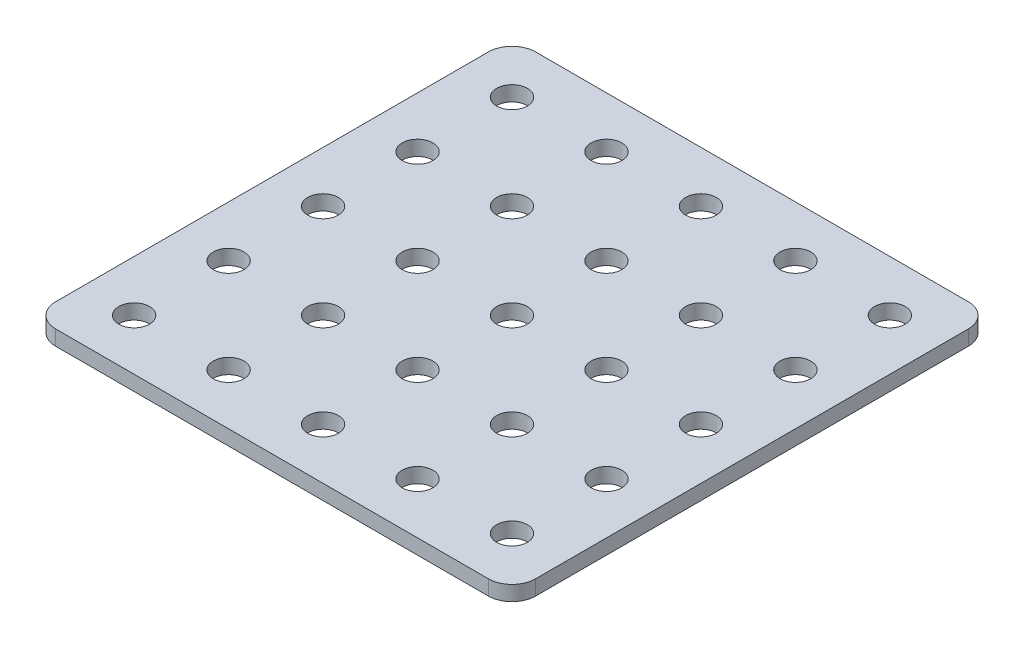
ISO-10303-21;
HEADER;
FILE_DESCRIPTION(('STEP AP214'),'2;1');
FILE_NAME('part.step','',(''),(''),'','','');
FILE_SCHEMA(('AUTOMOTIVE_DESIGN { 1 0 10303 214 1 1 1 1 }'));
ENDSEC;
DATA;
#1=APPLICATION_CONTEXT('core data for automotive mechanical design processes');
#2=APPLICATION_PROTOCOL_DEFINITION('international standard','automotive_design',2000,#1);
#3=PRODUCT_CONTEXT('',#1,'mechanical');
#4=PRODUCT('Part','Part','',(#3));
#5=PRODUCT_RELATED_PRODUCT_CATEGORY('part','',(#4));
#6=PRODUCT_DEFINITION_FORMATION('','',#4);
#7=PRODUCT_DEFINITION_CONTEXT('part definition',#1,'design');
#8=PRODUCT_DEFINITION('design','',#6,#7);
#9=PRODUCT_DEFINITION_SHAPE('','',#8);
#10=(LENGTH_UNIT() NAMED_UNIT(*) SI_UNIT(.MILLI.,.METRE.));
#11=(NAMED_UNIT(*) PLANE_ANGLE_UNIT() SI_UNIT($,.RADIAN.));
#12=(NAMED_UNIT(*) SI_UNIT($,.STERADIAN.) SOLID_ANGLE_UNIT());
#13=UNCERTAINTY_MEASURE_WITH_UNIT(LENGTH_MEASURE(1.E-05),#10,'distance_accuracy_value','');
#14=(GEOMETRIC_REPRESENTATION_CONTEXT(3) GLOBAL_UNCERTAINTY_ASSIGNED_CONTEXT((#13)) GLOBAL_UNIT_ASSIGNED_CONTEXT((#10,
#11,#12)) REPRESENTATION_CONTEXT('',''));
#15=CARTESIAN_POINT('',(0.,0.,0.));
#16=DIRECTION('',(0.,0.,1.));
#17=DIRECTION('',(1.,0.,0.));
#18=AXIS2_PLACEMENT_3D('',#15,#16,#17);
#19=CARTESIAN_POINT('',(50.8,3.175,-50.8));
#20=DIRECTION('',(-1.,0.,0.));
#21=DIRECTION('',(0.,0.,1.));
#22=AXIS2_PLACEMENT_3D('',#19,#20,#21);
#23=PLANE('',#22);
#24=DIRECTION('',(0.,0.,-1.));
#25=VECTOR('',#24,1.);
#26=CARTESIAN_POINT('',(50.8,0.,-50.8));
#27=LINE('',#26,#25);
#28=CARTESIAN_POINT('',(50.8,0.,45.8));
#29=VERTEX_POINT('',#28);
#30=CARTESIAN_POINT('',(50.8,0.,-45.8));
#31=VERTEX_POINT('',#30);
#32=EDGE_CURVE('E129',#29,#31,#27,.T.);
#33=ORIENTED_EDGE('',*,*,#32,.T.);
#34=DIRECTION('',(0.,-1.,0.));
#35=VECTOR('',#34,1.);
#36=CARTESIAN_POINT('',(50.8,3.175,-45.8));
#37=LINE('',#36,#35);
#38=CARTESIAN_POINT('',(50.8,3.175,-45.8));
#39=VERTEX_POINT('',#38);
#40=EDGE_CURVE('E106',#31,#39,#37,.F.);
#41=ORIENTED_EDGE('',*,*,#40,.T.);
#42=DIRECTION('',(0.,0.,-1.));
#43=VECTOR('',#42,1.);
#44=CARTESIAN_POINT('',(50.8,3.175,-50.8));
#45=LINE('',#44,#43);
#46=CARTESIAN_POINT('',(50.8,3.175,45.8));
#47=VERTEX_POINT('',#46);
#48=EDGE_CURVE('E139',#47,#39,#45,.T.);
#49=ORIENTED_EDGE('',*,*,#48,.F.);
#50=DIRECTION('',(0.,-1.,0.));
#51=VECTOR('',#50,1.);
#52=CARTESIAN_POINT('',(50.8,3.175,45.8));
#53=LINE('',#52,#51);
#54=EDGE_CURVE('E111',#47,#29,#53,.T.);
#55=ORIENTED_EDGE('',*,*,#54,.T.);
#56=EDGE_LOOP('',(#33,#41,#49,#55));
#57=FACE_BOUND('',#56,.T.);
#58=ADVANCED_FACE('F34',(#57),#23,.F.);
#59=CARTESIAN_POINT('',(-50.8,3.175,-50.8));
#60=DIRECTION('',(0.,0.,1.));
#61=DIRECTION('',(1.,0.,0.));
#62=AXIS2_PLACEMENT_3D('',#59,#60,#61);
#63=PLANE('',#62);
#64=DIRECTION('',(-1.,0.,0.));
#65=VECTOR('',#64,1.);
#66=CARTESIAN_POINT('',(-50.8,3.175,-50.8));
#67=LINE('',#66,#65);
#68=CARTESIAN_POINT('',(45.8,3.175,-50.8));
#69=VERTEX_POINT('',#68);
#70=CARTESIAN_POINT('',(-45.8,3.175,-50.8));
#71=VERTEX_POINT('',#70);
#72=EDGE_CURVE('E121',#69,#71,#67,.T.);
#73=ORIENTED_EDGE('',*,*,#72,.F.);
#74=DIRECTION('',(0.,-1.,0.));
#75=VECTOR('',#74,1.);
#76=CARTESIAN_POINT('',(45.8,3.175,-50.8));
#77=LINE('',#76,#75);
#78=CARTESIAN_POINT('',(45.8,0.,-50.8));
#79=VERTEX_POINT('',#78);
#80=EDGE_CURVE('E105',#69,#79,#77,.T.);
#81=ORIENTED_EDGE('',*,*,#80,.T.);
#82=DIRECTION('',(-1.,0.,0.));
#83=VECTOR('',#82,1.);
#84=CARTESIAN_POINT('',(-50.8,0.,-50.8));
#85=LINE('',#84,#83);
#86=CARTESIAN_POINT('',(-45.8,0.,-50.8));
#87=VERTEX_POINT('',#86);
#88=EDGE_CURVE('E118',#79,#87,#85,.T.);
#89=ORIENTED_EDGE('',*,*,#88,.T.);
#90=DIRECTION('',(0.,-1.,0.));
#91=VECTOR('',#90,1.);
#92=CARTESIAN_POINT('',(-45.8,3.175,-50.8));
#93=LINE('',#92,#91);
#94=EDGE_CURVE('E123',#87,#71,#93,.F.);
#95=ORIENTED_EDGE('',*,*,#94,.T.);
#96=EDGE_LOOP('',(#73,#81,#89,#95));
#97=FACE_BOUND('',#96,.T.);
#98=ADVANCED_FACE('F117',(#97),#63,.F.);
#99=CARTESIAN_POINT('',(-50.8,3.175,-50.8));
#100=DIRECTION('',(1.,0.,0.));
#101=DIRECTION('',(0.,0.,-1.));
#102=AXIS2_PLACEMENT_3D('',#99,#100,#101);
#103=PLANE('',#102);
#104=DIRECTION('',(0.,0.,1.));
#105=VECTOR('',#104,1.);
#106=CARTESIAN_POINT('',(-50.8,3.175,-50.8));
#107=LINE('',#106,#105);
#108=CARTESIAN_POINT('',(-50.8,3.175,-45.8));
#109=VERTEX_POINT('',#108);
#110=CARTESIAN_POINT('',(-50.8,3.175,45.8));
#111=VERTEX_POINT('',#110);
#112=EDGE_CURVE('E389',#109,#111,#107,.T.);
#113=ORIENTED_EDGE('',*,*,#112,.F.);
#114=DIRECTION('',(0.,-1.,0.));
#115=VECTOR('',#114,1.);
#116=CARTESIAN_POINT('',(-50.8,3.175,-45.8));
#117=LINE('',#116,#115);
#118=CARTESIAN_POINT('',(-50.8,0.,-45.8));
#119=VERTEX_POINT('',#118);
#120=EDGE_CURVE('E158',#109,#119,#117,.T.);
#121=ORIENTED_EDGE('',*,*,#120,.T.);
#122=DIRECTION('',(0.,0.,1.));
#123=VECTOR('',#122,1.);
#124=CARTESIAN_POINT('',(-50.8,0.,-50.8));
#125=LINE('',#124,#123);
#126=CARTESIAN_POINT('',(-50.8,0.,45.8));
#127=VERTEX_POINT('',#126);
#128=EDGE_CURVE('E128',#119,#127,#125,.T.);
#129=ORIENTED_EDGE('',*,*,#128,.T.);
#130=DIRECTION('',(0.,-1.,0.));
#131=VECTOR('',#130,1.);
#132=CARTESIAN_POINT('',(-50.8,3.175,45.8));
#133=LINE('',#132,#131);
#134=EDGE_CURVE('E156',#127,#111,#133,.F.);
#135=ORIENTED_EDGE('',*,*,#134,.T.);
#136=EDGE_LOOP('',(#113,#121,#129,#135));
#137=FACE_BOUND('',#136,.T.);
#138=ADVANCED_FACE('F238',(#137),#103,.F.);
#139=CARTESIAN_POINT('',(-50.8,3.175,50.8));
#140=DIRECTION('',(0.,0.,-1.));
#141=DIRECTION('',(-1.,0.,0.));
#142=AXIS2_PLACEMENT_3D('',#139,#140,#141);
#143=PLANE('',#142);
#144=DIRECTION('',(1.,0.,0.));
#145=VECTOR('',#144,1.);
#146=CARTESIAN_POINT('',(-50.8,3.175,50.8));
#147=LINE('',#146,#145);
#148=CARTESIAN_POINT('',(-45.8,3.175,50.8));
#149=VERTEX_POINT('',#148);
#150=CARTESIAN_POINT('',(45.8,3.175,50.8));
#151=VERTEX_POINT('',#150);
#152=EDGE_CURVE('E140',#149,#151,#147,.T.);
#153=ORIENTED_EDGE('',*,*,#152,.F.);
#154=DIRECTION('',(0.,-1.,0.));
#155=VECTOR('',#154,1.);
#156=CARTESIAN_POINT('',(-45.8,3.175,50.8));
#157=LINE('',#156,#155);
#158=CARTESIAN_POINT('',(-45.8,0.,50.8));
#159=VERTEX_POINT('',#158);
#160=EDGE_CURVE('E162',#149,#159,#157,.T.);
#161=ORIENTED_EDGE('',*,*,#160,.T.);
#162=DIRECTION('',(1.,0.,0.));
#163=VECTOR('',#162,1.);
#164=CARTESIAN_POINT('',(-50.8,0.,50.8));
#165=LINE('',#164,#163);
#166=CARTESIAN_POINT('',(45.8,0.,50.8));
#167=VERTEX_POINT('',#166);
#168=EDGE_CURVE('E132',#159,#167,#165,.T.);
#169=ORIENTED_EDGE('',*,*,#168,.T.);
#170=DIRECTION('',(0.,-1.,0.));
#171=VECTOR('',#170,1.);
#172=CARTESIAN_POINT('',(45.8,3.175,50.8));
#173=LINE('',#172,#171);
#174=EDGE_CURVE('E49',#167,#151,#173,.F.);
#175=ORIENTED_EDGE('',*,*,#174,.T.);
#176=EDGE_LOOP('',(#153,#161,#169,#175));
#177=FACE_BOUND('',#176,.T.);
#178=ADVANCED_FACE('F229',(#177),#143,.F.);
#179=CARTESIAN_POINT('',(0.,3.175,0.));
#180=DIRECTION('',(0.,1.,0.));
#181=DIRECTION('',(0.,0.,1.));
#182=AXIS2_PLACEMENT_3D('',#179,#180,#181);
#183=PLANE('',#182);
#184=CARTESIAN_POINT('',(-20.,3.175,-20.));
#185=DIRECTION('',(0.,1.,0.));
#186=DIRECTION('',(0.,0.,1.));
#187=AXIS2_PLACEMENT_3D('',#184,#185,#186);
#188=CIRCLE('',#187,3.25);
#189=CARTESIAN_POINT('',(-20.,3.175,-16.75));
#190=VERTEX_POINT('',#189);
#191=EDGE_CURVE('E699',#190,#190,#188,.T.);
#192=ORIENTED_EDGE('',*,*,#191,.F.);
#193=EDGE_LOOP('',(#192));
#194=FACE_BOUND('',#193,.T.);
#195=CARTESIAN_POINT('',(40.,3.175,-20.));
#196=DIRECTION('',(0.,1.,0.));
#197=DIRECTION('',(0.,0.,1.));
#198=AXIS2_PLACEMENT_3D('',#195,#196,#197);
#199=CIRCLE('',#198,3.25);
#200=CARTESIAN_POINT('',(40.,3.175,-16.75));
#201=VERTEX_POINT('',#200);
#202=EDGE_CURVE('E693',#201,#201,#199,.T.);
#203=ORIENTED_EDGE('',*,*,#202,.F.);
#204=EDGE_LOOP('',(#203));
#205=FACE_BOUND('',#204,.T.);
#206=CARTESIAN_POINT('',(20.,3.175,-20.));
#207=DIRECTION('',(0.,1.,0.));
#208=DIRECTION('',(0.,0.,1.));
#209=AXIS2_PLACEMENT_3D('',#206,#207,#208);
#210=CIRCLE('',#209,3.25);
#211=CARTESIAN_POINT('',(20.,3.175,-16.75));
#212=VERTEX_POINT('',#211);
#213=EDGE_CURVE('E687',#212,#212,#210,.T.);
#214=ORIENTED_EDGE('',*,*,#213,.F.);
#215=EDGE_LOOP('',(#214));
#216=FACE_BOUND('',#215,.T.);
#217=CARTESIAN_POINT('',(0.,3.175,-20.));
#218=DIRECTION('',(0.,1.,0.));
#219=DIRECTION('',(0.,0.,1.));
#220=AXIS2_PLACEMENT_3D('',#217,#218,#219);
#221=CIRCLE('',#220,3.25);
#222=CARTESIAN_POINT('',(0.,3.175,-16.75));
#223=VERTEX_POINT('',#222);
#224=EDGE_CURVE('E681',#223,#223,#221,.T.);
#225=ORIENTED_EDGE('',*,*,#224,.F.);
#226=EDGE_LOOP('',(#225));
#227=FACE_BOUND('',#226,.T.);
#228=CARTESIAN_POINT('',(-40.,3.175,-20.));
#229=DIRECTION('',(0.,1.,0.));
#230=DIRECTION('',(0.,0.,1.));
#231=AXIS2_PLACEMENT_3D('',#228,#229,#230);
#232=CIRCLE('',#231,3.25);
#233=CARTESIAN_POINT('',(-40.,3.175,-16.75));
#234=VERTEX_POINT('',#233);
#235=EDGE_CURVE('E675',#234,#234,#232,.T.);
#236=ORIENTED_EDGE('',*,*,#235,.F.);
#237=EDGE_LOOP('',(#236));
#238=FACE_BOUND('',#237,.T.);
#239=CARTESIAN_POINT('',(-20.,3.175,20.));
#240=DIRECTION('',(0.,1.,0.));
#241=DIRECTION('',(0.,0.,1.));
#242=AXIS2_PLACEMENT_3D('',#239,#240,#241);
#243=CIRCLE('',#242,3.25);
#244=CARTESIAN_POINT('',(-20.,3.175,23.25));
#245=VERTEX_POINT('',#244);
#246=EDGE_CURVE('E669',#245,#245,#243,.T.);
#247=ORIENTED_EDGE('',*,*,#246,.F.);
#248=EDGE_LOOP('',(#247));
#249=FACE_BOUND('',#248,.T.);
#250=CARTESIAN_POINT('',(40.,3.175,20.));
#251=DIRECTION('',(0.,1.,0.));
#252=DIRECTION('',(0.,0.,1.));
#253=AXIS2_PLACEMENT_3D('',#250,#251,#252);
#254=CIRCLE('',#253,3.25);
#255=CARTESIAN_POINT('',(40.,3.175,23.25));
#256=VERTEX_POINT('',#255);
#257=EDGE_CURVE('E663',#256,#256,#254,.T.);
#258=ORIENTED_EDGE('',*,*,#257,.F.);
#259=EDGE_LOOP('',(#258));
#260=FACE_BOUND('',#259,.T.);
#261=CARTESIAN_POINT('',(20.,3.175,20.));
#262=DIRECTION('',(0.,1.,0.));
#263=DIRECTION('',(0.,0.,1.));
#264=AXIS2_PLACEMENT_3D('',#261,#262,#263);
#265=CIRCLE('',#264,3.25);
#266=CARTESIAN_POINT('',(20.,3.175,23.25));
#267=VERTEX_POINT('',#266);
#268=EDGE_CURVE('E657',#267,#267,#265,.T.);
#269=ORIENTED_EDGE('',*,*,#268,.F.);
#270=EDGE_LOOP('',(#269));
#271=FACE_BOUND('',#270,.T.);
#272=CARTESIAN_POINT('',(0.,3.175,20.));
#273=DIRECTION('',(0.,1.,0.));
#274=DIRECTION('',(0.,0.,1.));
#275=AXIS2_PLACEMENT_3D('',#272,#273,#274);
#276=CIRCLE('',#275,3.25);
#277=CARTESIAN_POINT('',(0.,3.175,23.25));
#278=VERTEX_POINT('',#277);
#279=EDGE_CURVE('E651',#278,#278,#276,.T.);
#280=ORIENTED_EDGE('',*,*,#279,.F.);
#281=EDGE_LOOP('',(#280));
#282=FACE_BOUND('',#281,.T.);
#283=CARTESIAN_POINT('',(-40.,3.175,20.));
#284=DIRECTION('',(0.,1.,0.));
#285=DIRECTION('',(0.,0.,1.));
#286=AXIS2_PLACEMENT_3D('',#283,#284,#285);
#287=CIRCLE('',#286,3.25);
#288=CARTESIAN_POINT('',(-40.,3.175,23.25));
#289=VERTEX_POINT('',#288);
#290=EDGE_CURVE('E643',#289,#289,#287,.T.);
#291=ORIENTED_EDGE('',*,*,#290,.F.);
#292=EDGE_LOOP('',(#291));
#293=FACE_BOUND('',#292,.T.);
#294=CARTESIAN_POINT('',(-40.,3.175,0.));
#295=DIRECTION('',(0.,1.,0.));
#296=DIRECTION('',(0.,0.,1.));
#297=AXIS2_PLACEMENT_3D('',#294,#295,#296);
#298=CIRCLE('',#297,3.25);
#299=CARTESIAN_POINT('',(-40.,3.175,3.25));
#300=VERTEX_POINT('',#299);
#301=EDGE_CURVE('E640',#300,#300,#298,.T.);
#302=ORIENTED_EDGE('',*,*,#301,.F.);
#303=EDGE_LOOP('',(#302));
#304=FACE_BOUND('',#303,.T.);
#305=CARTESIAN_POINT('',(-20.,3.175,0.));
#306=DIRECTION('',(0.,1.,0.));
#307=DIRECTION('',(0.,0.,1.));
#308=AXIS2_PLACEMENT_3D('',#305,#306,#307);
#309=CIRCLE('',#308,3.25);
#310=CARTESIAN_POINT('',(-20.,3.175,3.25));
#311=VERTEX_POINT('',#310);
#312=EDGE_CURVE('E634',#311,#311,#309,.T.);
#313=ORIENTED_EDGE('',*,*,#312,.F.);
#314=EDGE_LOOP('',(#313));
#315=FACE_BOUND('',#314,.T.);
#316=CARTESIAN_POINT('',(40.,3.175,0.));
#317=DIRECTION('',(0.,1.,0.));
#318=DIRECTION('',(0.,0.,1.));
#319=AXIS2_PLACEMENT_3D('',#316,#317,#318);
#320=CIRCLE('',#319,3.25);
#321=CARTESIAN_POINT('',(40.,3.175,3.25));
#322=VERTEX_POINT('',#321);
#323=EDGE_CURVE('E628',#322,#322,#320,.T.);
#324=ORIENTED_EDGE('',*,*,#323,.F.);
#325=EDGE_LOOP('',(#324));
#326=FACE_BOUND('',#325,.T.);
#327=CARTESIAN_POINT('',(20.,3.175,0.));
#328=DIRECTION('',(0.,1.,0.));
#329=DIRECTION('',(0.,0.,1.));
#330=AXIS2_PLACEMENT_3D('',#327,#328,#329);
#331=CIRCLE('',#330,3.25);
#332=CARTESIAN_POINT('',(20.,3.175,3.25));
#333=VERTEX_POINT('',#332);
#334=EDGE_CURVE('E382',#333,#333,#331,.T.);
#335=ORIENTED_EDGE('',*,*,#334,.F.);
#336=EDGE_LOOP('',(#335));
#337=FACE_BOUND('',#336,.T.);
#338=CARTESIAN_POINT('',(0.,3.175,0.));
#339=DIRECTION('',(0.,1.,0.));
#340=DIRECTION('',(0.,0.,1.));
#341=AXIS2_PLACEMENT_3D('',#338,#339,#340);
#342=CIRCLE('',#341,3.25);
#343=CARTESIAN_POINT('',(0.,3.175,3.25));
#344=VERTEX_POINT('',#343);
#345=EDGE_CURVE('E376',#344,#344,#342,.T.);
#346=ORIENTED_EDGE('',*,*,#345,.F.);
#347=EDGE_LOOP('',(#346));
#348=FACE_BOUND('',#347,.T.);
#349=ORIENTED_EDGE('',*,*,#48,.T.);
#350=CARTESIAN_POINT('',(45.8,3.175,-45.8));
#351=DIRECTION('',(0.,1.,0.));
#352=DIRECTION('',(0.,0.,1.));
#353=AXIS2_PLACEMENT_3D('',#350,#351,#352);
#354=CIRCLE('',#353,5.);
#355=EDGE_CURVE('E154',#39,#69,#354,.T.);
#356=ORIENTED_EDGE('',*,*,#355,.T.);
#357=ORIENTED_EDGE('',*,*,#72,.T.);
#358=CARTESIAN_POINT('',(-45.8,3.175,-45.8));
#359=DIRECTION('',(0.,1.,0.));
#360=DIRECTION('',(0.,0.,1.));
#361=AXIS2_PLACEMENT_3D('',#358,#359,#360);
#362=CIRCLE('',#361,5.);
#363=EDGE_CURVE('E152',#71,#109,#362,.T.);
#364=ORIENTED_EDGE('',*,*,#363,.T.);
#365=ORIENTED_EDGE('',*,*,#112,.T.);
#366=CARTESIAN_POINT('',(-45.8,3.175,45.8));
#367=DIRECTION('',(0.,1.,0.));
#368=DIRECTION('',(0.,0.,1.));
#369=AXIS2_PLACEMENT_3D('',#366,#367,#368);
#370=CIRCLE('',#369,5.);
#371=EDGE_CURVE('E56',#111,#149,#370,.T.);
#372=ORIENTED_EDGE('',*,*,#371,.T.);
#373=ORIENTED_EDGE('',*,*,#152,.T.);
#374=CARTESIAN_POINT('',(45.8,3.175,45.8));
#375=DIRECTION('',(0.,1.,0.));
#376=DIRECTION('',(0.,0.,1.));
#377=AXIS2_PLACEMENT_3D('',#374,#375,#376);
#378=CIRCLE('',#377,5.);
#379=EDGE_CURVE('E149',#151,#47,#378,.T.);
#380=ORIENTED_EDGE('',*,*,#379,.T.);
#381=EDGE_LOOP('',(#349,#356,#357,#364,#365,#372,#373,#380));
#382=FACE_BOUND('',#381,.T.);
#383=CARTESIAN_POINT('',(-40.,3.175,40.));
#384=DIRECTION('',(0.,1.,0.));
#385=DIRECTION('',(0.,0.,1.));
#386=AXIS2_PLACEMENT_3D('',#383,#384,#385);
#387=CIRCLE('',#386,3.25);
#388=CARTESIAN_POINT('',(-40.,3.175,43.25));
#389=VERTEX_POINT('',#388);
#390=EDGE_CURVE('E168',#389,#389,#387,.T.);
#391=ORIENTED_EDGE('',*,*,#390,.F.);
#392=EDGE_LOOP('',(#391));
#393=FACE_BOUND('',#392,.T.);
#394=CARTESIAN_POINT('',(0.,3.175,40.));
#395=DIRECTION('',(0.,1.,0.));
#396=DIRECTION('',(0.,0.,1.));
#397=AXIS2_PLACEMENT_3D('',#394,#395,#396);
#398=CIRCLE('',#397,3.25);
#399=CARTESIAN_POINT('',(0.,3.175,43.25));
#400=VERTEX_POINT('',#399);
#401=EDGE_CURVE('E174',#400,#400,#398,.T.);
#402=ORIENTED_EDGE('',*,*,#401,.F.);
#403=EDGE_LOOP('',(#402));
#404=FACE_BOUND('',#403,.T.);
#405=CARTESIAN_POINT('',(20.,3.175,40.));
#406=DIRECTION('',(0.,1.,0.));
#407=DIRECTION('',(0.,0.,1.));
#408=AXIS2_PLACEMENT_3D('',#405,#406,#407);
#409=CIRCLE('',#408,3.25);
#410=CARTESIAN_POINT('',(20.,3.175,43.25));
#411=VERTEX_POINT('',#410);
#412=EDGE_CURVE('E180',#411,#411,#409,.T.);
#413=ORIENTED_EDGE('',*,*,#412,.F.);
#414=EDGE_LOOP('',(#413));
#415=FACE_BOUND('',#414,.T.);
#416=CARTESIAN_POINT('',(40.,3.175,40.));
#417=DIRECTION('',(0.,1.,0.));
#418=DIRECTION('',(0.,0.,1.));
#419=AXIS2_PLACEMENT_3D('',#416,#417,#418);
#420=CIRCLE('',#419,3.25);
#421=CARTESIAN_POINT('',(40.,3.175,43.25));
#422=VERTEX_POINT('',#421);
#423=EDGE_CURVE('E186',#422,#422,#420,.T.);
#424=ORIENTED_EDGE('',*,*,#423,.F.);
#425=EDGE_LOOP('',(#424));
#426=FACE_BOUND('',#425,.T.);
#427=CARTESIAN_POINT('',(-20.,3.175,40.));
#428=DIRECTION('',(0.,1.,0.));
#429=DIRECTION('',(0.,0.,1.));
#430=AXIS2_PLACEMENT_3D('',#427,#428,#429);
#431=CIRCLE('',#430,3.25);
#432=CARTESIAN_POINT('',(-20.,3.175,43.25));
#433=VERTEX_POINT('',#432);
#434=EDGE_CURVE('E192',#433,#433,#431,.T.);
#435=ORIENTED_EDGE('',*,*,#434,.F.);
#436=EDGE_LOOP('',(#435));
#437=FACE_BOUND('',#436,.T.);
#438=CARTESIAN_POINT('',(-40.,3.175,-40.));
#439=DIRECTION('',(0.,1.,0.));
#440=DIRECTION('',(0.,0.,1.));
#441=AXIS2_PLACEMENT_3D('',#438,#439,#440);
#442=CIRCLE('',#441,3.25);
#443=CARTESIAN_POINT('',(-40.,3.175,-36.75));
#444=VERTEX_POINT('',#443);
#445=EDGE_CURVE('E198',#444,#444,#442,.T.);
#446=ORIENTED_EDGE('',*,*,#445,.F.);
#447=EDGE_LOOP('',(#446));
#448=FACE_BOUND('',#447,.T.);
#449=CARTESIAN_POINT('',(0.,3.175,-40.));
#450=DIRECTION('',(0.,1.,0.));
#451=DIRECTION('',(0.,0.,1.));
#452=AXIS2_PLACEMENT_3D('',#449,#450,#451);
#453=CIRCLE('',#452,3.25);
#454=CARTESIAN_POINT('',(0.,3.175,-36.75));
#455=VERTEX_POINT('',#454);
#456=EDGE_CURVE('E204',#455,#455,#453,.T.);
#457=ORIENTED_EDGE('',*,*,#456,.F.);
#458=EDGE_LOOP('',(#457));
#459=FACE_BOUND('',#458,.T.);
#460=CARTESIAN_POINT('',(20.,3.175,-40.));
#461=DIRECTION('',(0.,1.,0.));
#462=DIRECTION('',(0.,0.,1.));
#463=AXIS2_PLACEMENT_3D('',#460,#461,#462);
#464=CIRCLE('',#463,3.25);
#465=CARTESIAN_POINT('',(20.,3.175,-36.75));
#466=VERTEX_POINT('',#465);
#467=EDGE_CURVE('E210',#466,#466,#464,.T.);
#468=ORIENTED_EDGE('',*,*,#467,.F.);
#469=EDGE_LOOP('',(#468));
#470=FACE_BOUND('',#469,.T.);
#471=CARTESIAN_POINT('',(40.,3.175,-40.));
#472=DIRECTION('',(0.,1.,0.));
#473=DIRECTION('',(0.,0.,1.));
#474=AXIS2_PLACEMENT_3D('',#471,#472,#473);
#475=CIRCLE('',#474,3.25);
#476=CARTESIAN_POINT('',(40.,3.175,-36.75));
#477=VERTEX_POINT('',#476);
#478=EDGE_CURVE('E216',#477,#477,#475,.T.);
#479=ORIENTED_EDGE('',*,*,#478,.F.);
#480=EDGE_LOOP('',(#479));
#481=FACE_BOUND('',#480,.T.);
#482=CARTESIAN_POINT('',(-20.,3.175,-40.));
#483=DIRECTION('',(0.,1.,0.));
#484=DIRECTION('',(0.,0.,1.));
#485=AXIS2_PLACEMENT_3D('',#482,#483,#484);
#486=CIRCLE('',#485,3.25);
#487=CARTESIAN_POINT('',(-20.,3.175,-36.75));
#488=VERTEX_POINT('',#487);
#489=EDGE_CURVE('E11',#488,#488,#486,.T.);
#490=ORIENTED_EDGE('',*,*,#489,.F.);
#491=EDGE_LOOP('',(#490));
#492=FACE_BOUND('',#491,.T.);
#493=ADVANCED_FACE('F227',(#194,#205,#216,#227,#238,#249,#260,#271,#282,#293,#304,#315,#326,
#337,#348,#382,#393,#404,#415,#426,#437,#448,#459,#470,#481,#492),#183,.T.);
#494=CARTESIAN_POINT('',(0.,0.,0.));
#495=DIRECTION('',(0.,1.,0.));
#496=DIRECTION('',(0.,0.,1.));
#497=AXIS2_PLACEMENT_3D('',#494,#495,#496);
#498=PLANE('',#497);
#499=CARTESIAN_POINT('',(-20.,0.,-20.));
#500=DIRECTION('',(0.,1.,0.));
#501=DIRECTION('',(0.,0.,1.));
#502=AXIS2_PLACEMENT_3D('',#499,#500,#501);
#503=CIRCLE('',#502,3.25);
#504=CARTESIAN_POINT('',(-20.,0.,-16.75));
#505=VERTEX_POINT('',#504);
#506=EDGE_CURVE('E702',#505,#505,#503,.T.);
#507=ORIENTED_EDGE('',*,*,#506,.T.);
#508=EDGE_LOOP('',(#507));
#509=FACE_BOUND('',#508,.T.);
#510=CARTESIAN_POINT('',(40.,0.,-20.));
#511=DIRECTION('',(0.,1.,0.));
#512=DIRECTION('',(0.,0.,1.));
#513=AXIS2_PLACEMENT_3D('',#510,#511,#512);
#514=CIRCLE('',#513,3.25);
#515=CARTESIAN_POINT('',(40.,0.,-16.75));
#516=VERTEX_POINT('',#515);
#517=EDGE_CURVE('E696',#516,#516,#514,.T.);
#518=ORIENTED_EDGE('',*,*,#517,.T.);
#519=EDGE_LOOP('',(#518));
#520=FACE_BOUND('',#519,.T.);
#521=CARTESIAN_POINT('',(20.,0.,-20.));
#522=DIRECTION('',(0.,1.,0.));
#523=DIRECTION('',(0.,0.,1.));
#524=AXIS2_PLACEMENT_3D('',#521,#522,#523);
#525=CIRCLE('',#524,3.25);
#526=CARTESIAN_POINT('',(20.,0.,-16.75));
#527=VERTEX_POINT('',#526);
#528=EDGE_CURVE('E690',#527,#527,#525,.T.);
#529=ORIENTED_EDGE('',*,*,#528,.T.);
#530=EDGE_LOOP('',(#529));
#531=FACE_BOUND('',#530,.T.);
#532=CARTESIAN_POINT('',(0.,0.,-20.));
#533=DIRECTION('',(0.,1.,0.));
#534=DIRECTION('',(0.,0.,1.));
#535=AXIS2_PLACEMENT_3D('',#532,#533,#534);
#536=CIRCLE('',#535,3.25);
#537=CARTESIAN_POINT('',(0.,0.,-16.75));
#538=VERTEX_POINT('',#537);
#539=EDGE_CURVE('E684',#538,#538,#536,.T.);
#540=ORIENTED_EDGE('',*,*,#539,.T.);
#541=EDGE_LOOP('',(#540));
#542=FACE_BOUND('',#541,.T.);
#543=CARTESIAN_POINT('',(-40.,0.,-20.));
#544=DIRECTION('',(0.,1.,0.));
#545=DIRECTION('',(0.,0.,1.));
#546=AXIS2_PLACEMENT_3D('',#543,#544,#545);
#547=CIRCLE('',#546,3.25);
#548=CARTESIAN_POINT('',(-40.,0.,-16.75));
#549=VERTEX_POINT('',#548);
#550=EDGE_CURVE('E678',#549,#549,#547,.T.);
#551=ORIENTED_EDGE('',*,*,#550,.T.);
#552=EDGE_LOOP('',(#551));
#553=FACE_BOUND('',#552,.T.);
#554=CARTESIAN_POINT('',(-20.,0.,20.));
#555=DIRECTION('',(0.,1.,0.));
#556=DIRECTION('',(0.,0.,1.));
#557=AXIS2_PLACEMENT_3D('',#554,#555,#556);
#558=CIRCLE('',#557,3.25);
#559=CARTESIAN_POINT('',(-20.,0.,23.25));
#560=VERTEX_POINT('',#559);
#561=EDGE_CURVE('E672',#560,#560,#558,.T.);
#562=ORIENTED_EDGE('',*,*,#561,.T.);
#563=EDGE_LOOP('',(#562));
#564=FACE_BOUND('',#563,.T.);
#565=CARTESIAN_POINT('',(40.,0.,20.));
#566=DIRECTION('',(0.,1.,0.));
#567=DIRECTION('',(0.,0.,1.));
#568=AXIS2_PLACEMENT_3D('',#565,#566,#567);
#569=CIRCLE('',#568,3.25);
#570=CARTESIAN_POINT('',(40.,0.,23.25));
#571=VERTEX_POINT('',#570);
#572=EDGE_CURVE('E666',#571,#571,#569,.T.);
#573=ORIENTED_EDGE('',*,*,#572,.T.);
#574=EDGE_LOOP('',(#573));
#575=FACE_BOUND('',#574,.T.);
#576=CARTESIAN_POINT('',(20.,0.,20.));
#577=DIRECTION('',(0.,1.,0.));
#578=DIRECTION('',(0.,0.,1.));
#579=AXIS2_PLACEMENT_3D('',#576,#577,#578);
#580=CIRCLE('',#579,3.25);
#581=CARTESIAN_POINT('',(20.,0.,23.25));
#582=VERTEX_POINT('',#581);
#583=EDGE_CURVE('E660',#582,#582,#580,.T.);
#584=ORIENTED_EDGE('',*,*,#583,.T.);
#585=EDGE_LOOP('',(#584));
#586=FACE_BOUND('',#585,.T.);
#587=CARTESIAN_POINT('',(0.,0.,20.));
#588=DIRECTION('',(0.,1.,0.));
#589=DIRECTION('',(0.,0.,1.));
#590=AXIS2_PLACEMENT_3D('',#587,#588,#589);
#591=CIRCLE('',#590,3.25);
#592=CARTESIAN_POINT('',(0.,0.,23.25));
#593=VERTEX_POINT('',#592);
#594=EDGE_CURVE('E654',#593,#593,#591,.T.);
#595=ORIENTED_EDGE('',*,*,#594,.T.);
#596=EDGE_LOOP('',(#595));
#597=FACE_BOUND('',#596,.T.);
#598=CARTESIAN_POINT('',(-40.,0.,20.));
#599=DIRECTION('',(0.,1.,0.));
#600=DIRECTION('',(0.,0.,1.));
#601=AXIS2_PLACEMENT_3D('',#598,#599,#600);
#602=CIRCLE('',#601,3.25);
#603=CARTESIAN_POINT('',(-40.,0.,23.25));
#604=VERTEX_POINT('',#603);
#605=EDGE_CURVE('E648',#604,#604,#602,.T.);
#606=ORIENTED_EDGE('',*,*,#605,.T.);
#607=EDGE_LOOP('',(#606));
#608=FACE_BOUND('',#607,.T.);
#609=CARTESIAN_POINT('',(-40.,0.,0.));
#610=DIRECTION('',(0.,1.,0.));
#611=DIRECTION('',(0.,0.,1.));
#612=AXIS2_PLACEMENT_3D('',#609,#610,#611);
#613=CIRCLE('',#612,3.25);
#614=CARTESIAN_POINT('',(-40.,0.,3.25));
#615=VERTEX_POINT('',#614);
#616=EDGE_CURVE('E637',#615,#615,#613,.T.);
#617=ORIENTED_EDGE('',*,*,#616,.T.);
#618=EDGE_LOOP('',(#617));
#619=FACE_BOUND('',#618,.T.);
#620=CARTESIAN_POINT('',(-20.,0.,0.));
#621=DIRECTION('',(0.,1.,0.));
#622=DIRECTION('',(0.,0.,1.));
#623=AXIS2_PLACEMENT_3D('',#620,#621,#622);
#624=CIRCLE('',#623,3.25);
#625=CARTESIAN_POINT('',(-20.,0.,3.25));
#626=VERTEX_POINT('',#625);
#627=EDGE_CURVE('E631',#626,#626,#624,.T.);
#628=ORIENTED_EDGE('',*,*,#627,.T.);
#629=EDGE_LOOP('',(#628));
#630=FACE_BOUND('',#629,.T.);
#631=CARTESIAN_POINT('',(40.,0.,0.));
#632=DIRECTION('',(0.,1.,0.));
#633=DIRECTION('',(0.,0.,1.));
#634=AXIS2_PLACEMENT_3D('',#631,#632,#633);
#635=CIRCLE('',#634,3.25);
#636=CARTESIAN_POINT('',(40.,0.,3.25));
#637=VERTEX_POINT('',#636);
#638=EDGE_CURVE('E626',#637,#637,#635,.T.);
#639=ORIENTED_EDGE('',*,*,#638,.T.);
#640=EDGE_LOOP('',(#639));
#641=FACE_BOUND('',#640,.T.);
#642=CARTESIAN_POINT('',(20.,0.,0.));
#643=DIRECTION('',(0.,1.,0.));
#644=DIRECTION('',(0.,0.,1.));
#645=AXIS2_PLACEMENT_3D('',#642,#643,#644);
#646=CIRCLE('',#645,3.25);
#647=CARTESIAN_POINT('',(20.,0.,3.25));
#648=VERTEX_POINT('',#647);
#649=EDGE_CURVE('E378',#648,#648,#646,.T.);
#650=ORIENTED_EDGE('',*,*,#649,.T.);
#651=EDGE_LOOP('',(#650));
#652=FACE_BOUND('',#651,.T.);
#653=CARTESIAN_POINT('',(0.,0.,0.));
#654=DIRECTION('',(0.,1.,0.));
#655=DIRECTION('',(0.,0.,1.));
#656=AXIS2_PLACEMENT_3D('',#653,#654,#655);
#657=CIRCLE('',#656,3.25);
#658=CARTESIAN_POINT('',(0.,0.,3.25));
#659=VERTEX_POINT('',#658);
#660=EDGE_CURVE('E134',#659,#659,#657,.T.);
#661=ORIENTED_EDGE('',*,*,#660,.T.);
#662=EDGE_LOOP('',(#661));
#663=FACE_BOUND('',#662,.T.);
#664=ORIENTED_EDGE('',*,*,#88,.F.);
#665=CARTESIAN_POINT('',(45.8,0.,-45.8));
#666=DIRECTION('',(0.,1.,0.));
#667=DIRECTION('',(0.,0.,1.));
#668=AXIS2_PLACEMENT_3D('',#665,#666,#667);
#669=CIRCLE('',#668,5.);
#670=EDGE_CURVE('E101',#79,#31,#669,.F.);
#671=ORIENTED_EDGE('',*,*,#670,.T.);
#672=ORIENTED_EDGE('',*,*,#32,.F.);
#673=CARTESIAN_POINT('',(45.8,0.,45.8));
#674=DIRECTION('',(0.,1.,0.));
#675=DIRECTION('',(0.,0.,1.));
#676=AXIS2_PLACEMENT_3D('',#673,#674,#675);
#677=CIRCLE('',#676,5.);
#678=EDGE_CURVE('E122',#29,#167,#677,.F.);
#679=ORIENTED_EDGE('',*,*,#678,.T.);
#680=ORIENTED_EDGE('',*,*,#168,.F.);
#681=CARTESIAN_POINT('',(-45.8,0.,45.8));
#682=DIRECTION('',(0.,1.,0.));
#683=DIRECTION('',(0.,0.,1.));
#684=AXIS2_PLACEMENT_3D('',#681,#682,#683);
#685=CIRCLE('',#684,5.);
#686=EDGE_CURVE('E143',#159,#127,#685,.F.);
#687=ORIENTED_EDGE('',*,*,#686,.T.);
#688=ORIENTED_EDGE('',*,*,#128,.F.);
#689=CARTESIAN_POINT('',(-45.8,0.,-45.8));
#690=DIRECTION('',(0.,1.,0.));
#691=DIRECTION('',(0.,0.,1.));
#692=AXIS2_PLACEMENT_3D('',#689,#690,#691);
#693=CIRCLE('',#692,5.);
#694=EDGE_CURVE('E112',#119,#87,#693,.F.);
#695=ORIENTED_EDGE('',*,*,#694,.T.);
#696=EDGE_LOOP('',(#664,#671,#672,#679,#680,#687,#688,#695));
#697=FACE_BOUND('',#696,.T.);
#698=CARTESIAN_POINT('',(-40.,0.,40.));
#699=DIRECTION('',(0.,1.,0.));
#700=DIRECTION('',(0.,0.,1.));
#701=AXIS2_PLACEMENT_3D('',#698,#699,#700);
#702=CIRCLE('',#701,3.25);
#703=CARTESIAN_POINT('',(-40.,0.,43.25));
#704=VERTEX_POINT('',#703);
#705=EDGE_CURVE('E165',#704,#704,#702,.T.);
#706=ORIENTED_EDGE('',*,*,#705,.T.);
#707=EDGE_LOOP('',(#706));
#708=FACE_BOUND('',#707,.T.);
#709=CARTESIAN_POINT('',(0.,0.,40.));
#710=DIRECTION('',(0.,1.,0.));
#711=DIRECTION('',(0.,0.,1.));
#712=AXIS2_PLACEMENT_3D('',#709,#710,#711);
#713=CIRCLE('',#712,3.25);
#714=CARTESIAN_POINT('',(0.,0.,43.25));
#715=VERTEX_POINT('',#714);
#716=EDGE_CURVE('E171',#715,#715,#713,.T.);
#717=ORIENTED_EDGE('',*,*,#716,.T.);
#718=EDGE_LOOP('',(#717));
#719=FACE_BOUND('',#718,.T.);
#720=CARTESIAN_POINT('',(20.,0.,40.));
#721=DIRECTION('',(0.,1.,0.));
#722=DIRECTION('',(0.,0.,1.));
#723=AXIS2_PLACEMENT_3D('',#720,#721,#722);
#724=CIRCLE('',#723,3.25);
#725=CARTESIAN_POINT('',(20.,0.,43.25));
#726=VERTEX_POINT('',#725);
#727=EDGE_CURVE('E177',#726,#726,#724,.T.);
#728=ORIENTED_EDGE('',*,*,#727,.T.);
#729=EDGE_LOOP('',(#728));
#730=FACE_BOUND('',#729,.T.);
#731=CARTESIAN_POINT('',(40.,0.,40.));
#732=DIRECTION('',(0.,1.,0.));
#733=DIRECTION('',(0.,0.,1.));
#734=AXIS2_PLACEMENT_3D('',#731,#732,#733);
#735=CIRCLE('',#734,3.25);
#736=CARTESIAN_POINT('',(40.,0.,43.25));
#737=VERTEX_POINT('',#736);
#738=EDGE_CURVE('E183',#737,#737,#735,.T.);
#739=ORIENTED_EDGE('',*,*,#738,.T.);
#740=EDGE_LOOP('',(#739));
#741=FACE_BOUND('',#740,.T.);
#742=CARTESIAN_POINT('',(-20.,0.,40.));
#743=DIRECTION('',(0.,1.,0.));
#744=DIRECTION('',(0.,0.,1.));
#745=AXIS2_PLACEMENT_3D('',#742,#743,#744);
#746=CIRCLE('',#745,3.25);
#747=CARTESIAN_POINT('',(-20.,0.,43.25));
#748=VERTEX_POINT('',#747);
#749=EDGE_CURVE('E189',#748,#748,#746,.T.);
#750=ORIENTED_EDGE('',*,*,#749,.T.);
#751=EDGE_LOOP('',(#750));
#752=FACE_BOUND('',#751,.T.);
#753=CARTESIAN_POINT('',(-40.,0.,-40.));
#754=DIRECTION('',(0.,1.,0.));
#755=DIRECTION('',(0.,0.,1.));
#756=AXIS2_PLACEMENT_3D('',#753,#754,#755);
#757=CIRCLE('',#756,3.25);
#758=CARTESIAN_POINT('',(-40.,0.,-36.75));
#759=VERTEX_POINT('',#758);
#760=EDGE_CURVE('E195',#759,#759,#757,.T.);
#761=ORIENTED_EDGE('',*,*,#760,.T.);
#762=EDGE_LOOP('',(#761));
#763=FACE_BOUND('',#762,.T.);
#764=CARTESIAN_POINT('',(0.,0.,-40.));
#765=DIRECTION('',(0.,1.,0.));
#766=DIRECTION('',(0.,0.,1.));
#767=AXIS2_PLACEMENT_3D('',#764,#765,#766);
#768=CIRCLE('',#767,3.25);
#769=CARTESIAN_POINT('',(0.,0.,-36.75));
#770=VERTEX_POINT('',#769);
#771=EDGE_CURVE('E201',#770,#770,#768,.T.);
#772=ORIENTED_EDGE('',*,*,#771,.T.);
#773=EDGE_LOOP('',(#772));
#774=FACE_BOUND('',#773,.T.);
#775=CARTESIAN_POINT('',(20.,0.,-40.));
#776=DIRECTION('',(0.,1.,0.));
#777=DIRECTION('',(0.,0.,1.));
#778=AXIS2_PLACEMENT_3D('',#775,#776,#777);
#779=CIRCLE('',#778,3.25);
#780=CARTESIAN_POINT('',(20.,0.,-36.75));
#781=VERTEX_POINT('',#780);
#782=EDGE_CURVE('E207',#781,#781,#779,.T.);
#783=ORIENTED_EDGE('',*,*,#782,.T.);
#784=EDGE_LOOP('',(#783));
#785=FACE_BOUND('',#784,.T.);
#786=CARTESIAN_POINT('',(40.,0.,-40.));
#787=DIRECTION('',(0.,1.,0.));
#788=DIRECTION('',(0.,0.,1.));
#789=AXIS2_PLACEMENT_3D('',#786,#787,#788);
#790=CIRCLE('',#789,3.25);
#791=CARTESIAN_POINT('',(40.,0.,-36.75));
#792=VERTEX_POINT('',#791);
#793=EDGE_CURVE('E213',#792,#792,#790,.T.);
#794=ORIENTED_EDGE('',*,*,#793,.T.);
#795=EDGE_LOOP('',(#794));
#796=FACE_BOUND('',#795,.T.);
#797=CARTESIAN_POINT('',(-20.,0.,-40.));
#798=DIRECTION('',(0.,1.,0.));
#799=DIRECTION('',(0.,0.,1.));
#800=AXIS2_PLACEMENT_3D('',#797,#798,#799);
#801=CIRCLE('',#800,3.25);
#802=CARTESIAN_POINT('',(-20.,0.,-36.75));
#803=VERTEX_POINT('',#802);
#804=EDGE_CURVE('E42',#803,#803,#801,.T.);
#805=ORIENTED_EDGE('',*,*,#804,.T.);
#806=EDGE_LOOP('',(#805));
#807=FACE_BOUND('',#806,.T.);
#808=ADVANCED_FACE('F125',(#509,#520,#531,#542,#553,#564,#575,#586,#597,#608,#619,#630,#641,
#652,#663,#697,#708,#719,#730,#741,#752,#763,#774,#785,#796,#807),#498,.F.);
#809=CARTESIAN_POINT('',(45.8,3.175,-45.8));
#810=DIRECTION('',(0.,-1.,0.));
#811=DIRECTION('',(0.,0.,-1.));
#812=AXIS2_PLACEMENT_3D('',#809,#810,#811);
#813=CYLINDRICAL_SURFACE('',#812,5.);
#814=ORIENTED_EDGE('',*,*,#355,.F.);
#815=ORIENTED_EDGE('',*,*,#40,.F.);
#816=ORIENTED_EDGE('',*,*,#670,.F.);
#817=ORIENTED_EDGE('',*,*,#80,.F.);
#818=EDGE_LOOP('',(#814,#815,#816,#817));
#819=FACE_BOUND('',#818,.T.);
#820=ADVANCED_FACE('F104',(#819),#813,.T.);
#821=CARTESIAN_POINT('',(-45.8,3.175,-45.8));
#822=DIRECTION('',(0.,-1.,0.));
#823=DIRECTION('',(0.,0.,-1.));
#824=AXIS2_PLACEMENT_3D('',#821,#822,#823);
#825=CYLINDRICAL_SURFACE('',#824,5.);
#826=ORIENTED_EDGE('',*,*,#363,.F.);
#827=ORIENTED_EDGE('',*,*,#94,.F.);
#828=ORIENTED_EDGE('',*,*,#694,.F.);
#829=ORIENTED_EDGE('',*,*,#120,.F.);
#830=EDGE_LOOP('',(#826,#827,#828,#829));
#831=FACE_BOUND('',#830,.T.);
#832=ADVANCED_FACE('F254',(#831),#825,.T.);
#833=CARTESIAN_POINT('',(-45.8,3.175,45.8));
#834=DIRECTION('',(0.,-1.,0.));
#835=DIRECTION('',(0.,0.,-1.));
#836=AXIS2_PLACEMENT_3D('',#833,#834,#835);
#837=CYLINDRICAL_SURFACE('',#836,5.);
#838=ORIENTED_EDGE('',*,*,#371,.F.);
#839=ORIENTED_EDGE('',*,*,#134,.F.);
#840=ORIENTED_EDGE('',*,*,#686,.F.);
#841=ORIENTED_EDGE('',*,*,#160,.F.);
#842=EDGE_LOOP('',(#838,#839,#840,#841));
#843=FACE_BOUND('',#842,.T.);
#844=ADVANCED_FACE('F257',(#843),#837,.T.);
#845=CARTESIAN_POINT('',(45.8,3.175,45.8));
#846=DIRECTION('',(0.,-1.,0.));
#847=DIRECTION('',(0.,0.,-1.));
#848=AXIS2_PLACEMENT_3D('',#845,#846,#847);
#849=CYLINDRICAL_SURFACE('',#848,5.);
#850=ORIENTED_EDGE('',*,*,#379,.F.);
#851=ORIENTED_EDGE('',*,*,#174,.F.);
#852=ORIENTED_EDGE('',*,*,#678,.F.);
#853=ORIENTED_EDGE('',*,*,#54,.F.);
#854=EDGE_LOOP('',(#850,#851,#852,#853));
#855=FACE_BOUND('',#854,.T.);
#856=ADVANCED_FACE('F261',(#855),#849,.T.);
#857=CARTESIAN_POINT('',(0.,0.,0.));
#858=DIRECTION('',(0.,1.,0.));
#859=DIRECTION('',(0.,0.,1.));
#860=AXIS2_PLACEMENT_3D('',#857,#858,#859);
#861=CYLINDRICAL_SURFACE('',#860,3.25);
#862=ORIENTED_EDGE('',*,*,#660,.F.);
#863=EDGE_LOOP('',(#862));
#864=FACE_BOUND('',#863,.T.);
#865=ORIENTED_EDGE('',*,*,#345,.T.);
#866=EDGE_LOOP('',(#865));
#867=FACE_BOUND('',#866,.T.);
#868=ADVANCED_FACE('F265',(#864,#867),#861,.F.);
#869=CARTESIAN_POINT('',(20.,0.,0.));
#870=DIRECTION('',(0.,1.,0.));
#871=DIRECTION('',(0.,0.,1.));
#872=AXIS2_PLACEMENT_3D('',#869,#870,#871);
#873=CYLINDRICAL_SURFACE('',#872,3.25);
#874=ORIENTED_EDGE('',*,*,#649,.F.);
#875=EDGE_LOOP('',(#874));
#876=FACE_BOUND('',#875,.T.);
#877=ORIENTED_EDGE('',*,*,#334,.T.);
#878=EDGE_LOOP('',(#877));
#879=FACE_BOUND('',#878,.T.);
#880=ADVANCED_FACE('F363',(#876,#879),#873,.F.);
#881=CARTESIAN_POINT('',(40.,0.,0.));
#882=DIRECTION('',(0.,1.,0.));
#883=DIRECTION('',(0.,0.,1.));
#884=AXIS2_PLACEMENT_3D('',#881,#882,#883);
#885=CYLINDRICAL_SURFACE('',#884,3.25);
#886=ORIENTED_EDGE('',*,*,#638,.F.);
#887=EDGE_LOOP('',(#886));
#888=FACE_BOUND('',#887,.T.);
#889=ORIENTED_EDGE('',*,*,#323,.T.);
#890=EDGE_LOOP('',(#889));
#891=FACE_BOUND('',#890,.T.);
#892=ADVANCED_FACE('F359',(#888,#891),#885,.F.);
#893=CARTESIAN_POINT('',(-20.,0.,0.));
#894=DIRECTION('',(0.,1.,0.));
#895=DIRECTION('',(0.,0.,1.));
#896=AXIS2_PLACEMENT_3D('',#893,#894,#895);
#897=CYLINDRICAL_SURFACE('',#896,3.25);
#898=ORIENTED_EDGE('',*,*,#627,.F.);
#899=EDGE_LOOP('',(#898));
#900=FACE_BOUND('',#899,.T.);
#901=ORIENTED_EDGE('',*,*,#312,.T.);
#902=EDGE_LOOP('',(#901));
#903=FACE_BOUND('',#902,.T.);
#904=ADVANCED_FACE('F355',(#900,#903),#897,.F.);
#905=CARTESIAN_POINT('',(-40.,0.,0.));
#906=DIRECTION('',(0.,1.,0.));
#907=DIRECTION('',(0.,0.,1.));
#908=AXIS2_PLACEMENT_3D('',#905,#906,#907);
#909=CYLINDRICAL_SURFACE('',#908,3.25);
#910=ORIENTED_EDGE('',*,*,#616,.F.);
#911=EDGE_LOOP('',(#910));
#912=FACE_BOUND('',#911,.T.);
#913=ORIENTED_EDGE('',*,*,#301,.T.);
#914=EDGE_LOOP('',(#913));
#915=FACE_BOUND('',#914,.T.);
#916=ADVANCED_FACE('F351',(#912,#915),#909,.F.);
#917=CARTESIAN_POINT('',(-40.,0.,20.));
#918=DIRECTION('',(0.,1.,0.));
#919=DIRECTION('',(0.,0.,1.));
#920=AXIS2_PLACEMENT_3D('',#917,#918,#919);
#921=CYLINDRICAL_SURFACE('',#920,3.25);
#922=ORIENTED_EDGE('',*,*,#605,.F.);
#923=EDGE_LOOP('',(#922));
#924=FACE_BOUND('',#923,.T.);
#925=ORIENTED_EDGE('',*,*,#290,.T.);
#926=EDGE_LOOP('',(#925));
#927=FACE_BOUND('',#926,.T.);
#928=ADVANCED_FACE('F271',(#924,#927),#921,.F.);
#929=CARTESIAN_POINT('',(-40.,0.,40.));
#930=DIRECTION('',(0.,1.,0.));
#931=DIRECTION('',(0.,0.,1.));
#932=AXIS2_PLACEMENT_3D('',#929,#930,#931);
#933=CYLINDRICAL_SURFACE('',#932,3.25);
#934=ORIENTED_EDGE('',*,*,#705,.F.);
#935=EDGE_LOOP('',(#934));
#936=FACE_BOUND('',#935,.T.);
#937=ORIENTED_EDGE('',*,*,#390,.T.);
#938=EDGE_LOOP('',(#937));
#939=FACE_BOUND('',#938,.T.);
#940=ADVANCED_FACE('F267',(#936,#939),#933,.F.);
#941=CARTESIAN_POINT('',(0.,0.,20.));
#942=DIRECTION('',(0.,1.,0.));
#943=DIRECTION('',(0.,0.,1.));
#944=AXIS2_PLACEMENT_3D('',#941,#942,#943);
#945=CYLINDRICAL_SURFACE('',#944,3.25);
#946=ORIENTED_EDGE('',*,*,#594,.F.);
#947=EDGE_LOOP('',(#946));
#948=FACE_BOUND('',#947,.T.);
#949=ORIENTED_EDGE('',*,*,#279,.T.);
#950=EDGE_LOOP('',(#949));
#951=FACE_BOUND('',#950,.T.);
#952=ADVANCED_FACE('F270',(#948,#951),#945,.F.);
#953=CARTESIAN_POINT('',(0.,0.,40.));
#954=DIRECTION('',(0.,1.,0.));
#955=DIRECTION('',(0.,0.,1.));
#956=AXIS2_PLACEMENT_3D('',#953,#954,#955);
#957=CYLINDRICAL_SURFACE('',#956,3.25);
#958=ORIENTED_EDGE('',*,*,#716,.F.);
#959=EDGE_LOOP('',(#958));
#960=FACE_BOUND('',#959,.T.);
#961=ORIENTED_EDGE('',*,*,#401,.T.);
#962=EDGE_LOOP('',(#961));
#963=FACE_BOUND('',#962,.T.);
#964=ADVANCED_FACE('F273',(#960,#963),#957,.F.);
#965=CARTESIAN_POINT('',(20.,0.,20.));
#966=DIRECTION('',(0.,1.,0.));
#967=DIRECTION('',(0.,0.,1.));
#968=AXIS2_PLACEMENT_3D('',#965,#966,#967);
#969=CYLINDRICAL_SURFACE('',#968,3.25);
#970=ORIENTED_EDGE('',*,*,#583,.F.);
#971=EDGE_LOOP('',(#970));
#972=FACE_BOUND('',#971,.T.);
#973=ORIENTED_EDGE('',*,*,#268,.T.);
#974=EDGE_LOOP('',(#973));
#975=FACE_BOUND('',#974,.T.);
#976=ADVANCED_FACE('F276',(#972,#975),#969,.F.);
#977=CARTESIAN_POINT('',(20.,0.,40.));
#978=DIRECTION('',(0.,1.,0.));
#979=DIRECTION('',(0.,0.,1.));
#980=AXIS2_PLACEMENT_3D('',#977,#978,#979);
#981=CYLINDRICAL_SURFACE('',#980,3.25);
#982=ORIENTED_EDGE('',*,*,#727,.F.);
#983=EDGE_LOOP('',(#982));
#984=FACE_BOUND('',#983,.T.);
#985=ORIENTED_EDGE('',*,*,#412,.T.);
#986=EDGE_LOOP('',(#985));
#987=FACE_BOUND('',#986,.T.);
#988=ADVANCED_FACE('F278',(#984,#987),#981,.F.);
#989=CARTESIAN_POINT('',(40.,0.,20.));
#990=DIRECTION('',(0.,1.,0.));
#991=DIRECTION('',(0.,0.,1.));
#992=AXIS2_PLACEMENT_3D('',#989,#990,#991);
#993=CYLINDRICAL_SURFACE('',#992,3.25);
#994=ORIENTED_EDGE('',*,*,#572,.F.);
#995=EDGE_LOOP('',(#994));
#996=FACE_BOUND('',#995,.T.);
#997=ORIENTED_EDGE('',*,*,#257,.T.);
#998=EDGE_LOOP('',(#997));
#999=FACE_BOUND('',#998,.T.);
#1000=ADVANCED_FACE('F281',(#996,#999),#993,.F.);
#1001=CARTESIAN_POINT('',(40.,0.,40.));
#1002=DIRECTION('',(0.,1.,0.));
#1003=DIRECTION('',(0.,0.,1.));
#1004=AXIS2_PLACEMENT_3D('',#1001,#1002,#1003);
#1005=CYLINDRICAL_SURFACE('',#1004,3.25);
#1006=ORIENTED_EDGE('',*,*,#738,.F.);
#1007=EDGE_LOOP('',(#1006));
#1008=FACE_BOUND('',#1007,.T.);
#1009=ORIENTED_EDGE('',*,*,#423,.T.);
#1010=EDGE_LOOP('',(#1009));
#1011=FACE_BOUND('',#1010,.T.);
#1012=ADVANCED_FACE('F283',(#1008,#1011),#1005,.F.);
#1013=CARTESIAN_POINT('',(-20.,0.,20.));
#1014=DIRECTION('',(0.,1.,0.));
#1015=DIRECTION('',(0.,0.,1.));
#1016=AXIS2_PLACEMENT_3D('',#1013,#1014,#1015);
#1017=CYLINDRICAL_SURFACE('',#1016,3.25);
#1018=ORIENTED_EDGE('',*,*,#561,.F.);
#1019=EDGE_LOOP('',(#1018));
#1020=FACE_BOUND('',#1019,.T.);
#1021=ORIENTED_EDGE('',*,*,#246,.T.);
#1022=EDGE_LOOP('',(#1021));
#1023=FACE_BOUND('',#1022,.T.);
#1024=ADVANCED_FACE('F286',(#1020,#1023),#1017,.F.);
#1025=CARTESIAN_POINT('',(-20.,0.,40.));
#1026=DIRECTION('',(0.,1.,0.));
#1027=DIRECTION('',(0.,0.,1.));
#1028=AXIS2_PLACEMENT_3D('',#1025,#1026,#1027);
#1029=CYLINDRICAL_SURFACE('',#1028,3.25);
#1030=ORIENTED_EDGE('',*,*,#749,.F.);
#1031=EDGE_LOOP('',(#1030));
#1032=FACE_BOUND('',#1031,.T.);
#1033=ORIENTED_EDGE('',*,*,#434,.T.);
#1034=EDGE_LOOP('',(#1033));
#1035=FACE_BOUND('',#1034,.T.);
#1036=ADVANCED_FACE('F288',(#1032,#1035),#1029,.F.);
#1037=CARTESIAN_POINT('',(-40.,0.,-20.));
#1038=DIRECTION('',(0.,1.,0.));
#1039=DIRECTION('',(0.,0.,1.));
#1040=AXIS2_PLACEMENT_3D('',#1037,#1038,#1039);
#1041=CYLINDRICAL_SURFACE('',#1040,3.25);
#1042=ORIENTED_EDGE('',*,*,#550,.F.);
#1043=EDGE_LOOP('',(#1042));
#1044=FACE_BOUND('',#1043,.T.);
#1045=ORIENTED_EDGE('',*,*,#235,.T.);
#1046=EDGE_LOOP('',(#1045));
#1047=FACE_BOUND('',#1046,.T.);
#1048=ADVANCED_FACE('F291',(#1044,#1047),#1041,.F.);
#1049=CARTESIAN_POINT('',(-40.,0.,-40.));
#1050=DIRECTION('',(0.,1.,0.));
#1051=DIRECTION('',(0.,0.,1.));
#1052=AXIS2_PLACEMENT_3D('',#1049,#1050,#1051);
#1053=CYLINDRICAL_SURFACE('',#1052,3.25);
#1054=ORIENTED_EDGE('',*,*,#760,.F.);
#1055=EDGE_LOOP('',(#1054));
#1056=FACE_BOUND('',#1055,.T.);
#1057=ORIENTED_EDGE('',*,*,#445,.T.);
#1058=EDGE_LOOP('',(#1057));
#1059=FACE_BOUND('',#1058,.T.);
#1060=ADVANCED_FACE('F293',(#1056,#1059),#1053,.F.);
#1061=CARTESIAN_POINT('',(0.,0.,-20.));
#1062=DIRECTION('',(0.,1.,0.));
#1063=DIRECTION('',(0.,0.,1.));
#1064=AXIS2_PLACEMENT_3D('',#1061,#1062,#1063);
#1065=CYLINDRICAL_SURFACE('',#1064,3.25);
#1066=ORIENTED_EDGE('',*,*,#539,.F.);
#1067=EDGE_LOOP('',(#1066));
#1068=FACE_BOUND('',#1067,.T.);
#1069=ORIENTED_EDGE('',*,*,#224,.T.);
#1070=EDGE_LOOP('',(#1069));
#1071=FACE_BOUND('',#1070,.T.);
#1072=ADVANCED_FACE('F296',(#1068,#1071),#1065,.F.);
#1073=CARTESIAN_POINT('',(0.,0.,-40.));
#1074=DIRECTION('',(0.,1.,0.));
#1075=DIRECTION('',(0.,0.,1.));
#1076=AXIS2_PLACEMENT_3D('',#1073,#1074,#1075);
#1077=CYLINDRICAL_SURFACE('',#1076,3.25);
#1078=ORIENTED_EDGE('',*,*,#771,.F.);
#1079=EDGE_LOOP('',(#1078));
#1080=FACE_BOUND('',#1079,.T.);
#1081=ORIENTED_EDGE('',*,*,#456,.T.);
#1082=EDGE_LOOP('',(#1081));
#1083=FACE_BOUND('',#1082,.T.);
#1084=ADVANCED_FACE('F298',(#1080,#1083),#1077,.F.);
#1085=CARTESIAN_POINT('',(20.,0.,-20.));
#1086=DIRECTION('',(0.,1.,0.));
#1087=DIRECTION('',(0.,0.,1.));
#1088=AXIS2_PLACEMENT_3D('',#1085,#1086,#1087);
#1089=CYLINDRICAL_SURFACE('',#1088,3.25);
#1090=ORIENTED_EDGE('',*,*,#528,.F.);
#1091=EDGE_LOOP('',(#1090));
#1092=FACE_BOUND('',#1091,.T.);
#1093=ORIENTED_EDGE('',*,*,#213,.T.);
#1094=EDGE_LOOP('',(#1093));
#1095=FACE_BOUND('',#1094,.T.);
#1096=ADVANCED_FACE('F301',(#1092,#1095),#1089,.F.);
#1097=CARTESIAN_POINT('',(20.,0.,-40.));
#1098=DIRECTION('',(0.,1.,0.));
#1099=DIRECTION('',(0.,0.,1.));
#1100=AXIS2_PLACEMENT_3D('',#1097,#1098,#1099);
#1101=CYLINDRICAL_SURFACE('',#1100,3.25);
#1102=ORIENTED_EDGE('',*,*,#782,.F.);
#1103=EDGE_LOOP('',(#1102));
#1104=FACE_BOUND('',#1103,.T.);
#1105=ORIENTED_EDGE('',*,*,#467,.T.);
#1106=EDGE_LOOP('',(#1105));
#1107=FACE_BOUND('',#1106,.T.);
#1108=ADVANCED_FACE('F303',(#1104,#1107),#1101,.F.);
#1109=CARTESIAN_POINT('',(40.,0.,-20.));
#1110=DIRECTION('',(0.,1.,0.));
#1111=DIRECTION('',(0.,0.,1.));
#1112=AXIS2_PLACEMENT_3D('',#1109,#1110,#1111);
#1113=CYLINDRICAL_SURFACE('',#1112,3.25);
#1114=ORIENTED_EDGE('',*,*,#517,.F.);
#1115=EDGE_LOOP('',(#1114));
#1116=FACE_BOUND('',#1115,.T.);
#1117=ORIENTED_EDGE('',*,*,#202,.T.);
#1118=EDGE_LOOP('',(#1117));
#1119=FACE_BOUND('',#1118,.T.);
#1120=ADVANCED_FACE('F305',(#1116,#1119),#1113,.F.);
#1121=CARTESIAN_POINT('',(40.,0.,-40.));
#1122=DIRECTION('',(0.,1.,0.));
#1123=DIRECTION('',(0.,0.,1.));
#1124=AXIS2_PLACEMENT_3D('',#1121,#1122,#1123);
#1125=CYLINDRICAL_SURFACE('',#1124,3.25);
#1126=ORIENTED_EDGE('',*,*,#793,.F.);
#1127=EDGE_LOOP('',(#1126));
#1128=FACE_BOUND('',#1127,.T.);
#1129=ORIENTED_EDGE('',*,*,#478,.T.);
#1130=EDGE_LOOP('',(#1129));
#1131=FACE_BOUND('',#1130,.T.);
#1132=ADVANCED_FACE('F307',(#1128,#1131),#1125,.F.);
#1133=CARTESIAN_POINT('',(-20.,0.,-20.));
#1134=DIRECTION('',(0.,1.,0.));
#1135=DIRECTION('',(0.,0.,1.));
#1136=AXIS2_PLACEMENT_3D('',#1133,#1134,#1135);
#1137=CYLINDRICAL_SURFACE('',#1136,3.25);
#1138=ORIENTED_EDGE('',*,*,#506,.F.);
#1139=EDGE_LOOP('',(#1138));
#1140=FACE_BOUND('',#1139,.T.);
#1141=ORIENTED_EDGE('',*,*,#191,.T.);
#1142=EDGE_LOOP('',(#1141));
#1143=FACE_BOUND('',#1142,.T.);
#1144=ADVANCED_FACE('F224',(#1140,#1143),#1137,.F.);
#1145=CARTESIAN_POINT('',(-20.,0.,-40.));
#1146=DIRECTION('',(0.,1.,0.));
#1147=DIRECTION('',(0.,0.,1.));
#1148=AXIS2_PLACEMENT_3D('',#1145,#1146,#1147);
#1149=CYLINDRICAL_SURFACE('',#1148,3.25);
#1150=ORIENTED_EDGE('',*,*,#804,.F.);
#1151=EDGE_LOOP('',(#1150));
#1152=FACE_BOUND('',#1151,.T.);
#1153=ORIENTED_EDGE('',*,*,#489,.T.);
#1154=EDGE_LOOP('',(#1153));
#1155=FACE_BOUND('',#1154,.T.);
#1156=ADVANCED_FACE('F36',(#1152,#1155),#1149,.F.);
#1157=CLOSED_SHELL('',(#58,#98,#138,#178,#493,#808,#820,#832,#844,#856,#868,#880,#892,#904,#916,
#928,#940,#952,#964,#976,#988,#1000,#1012,#1024,#1036,#1048,#1060,#1072,#1084,#1096,#1108,#1120,
#1132,#1144,#1156));
#1158=MANIFOLD_SOLID_BREP('B2',#1157);
#1159=ADVANCED_BREP_SHAPE_REPRESENTATION('',(#18,#1158),#14);
#1160=SHAPE_DEFINITION_REPRESENTATION(#9,#1159);
ENDSEC;
END-ISO-10303-21;
